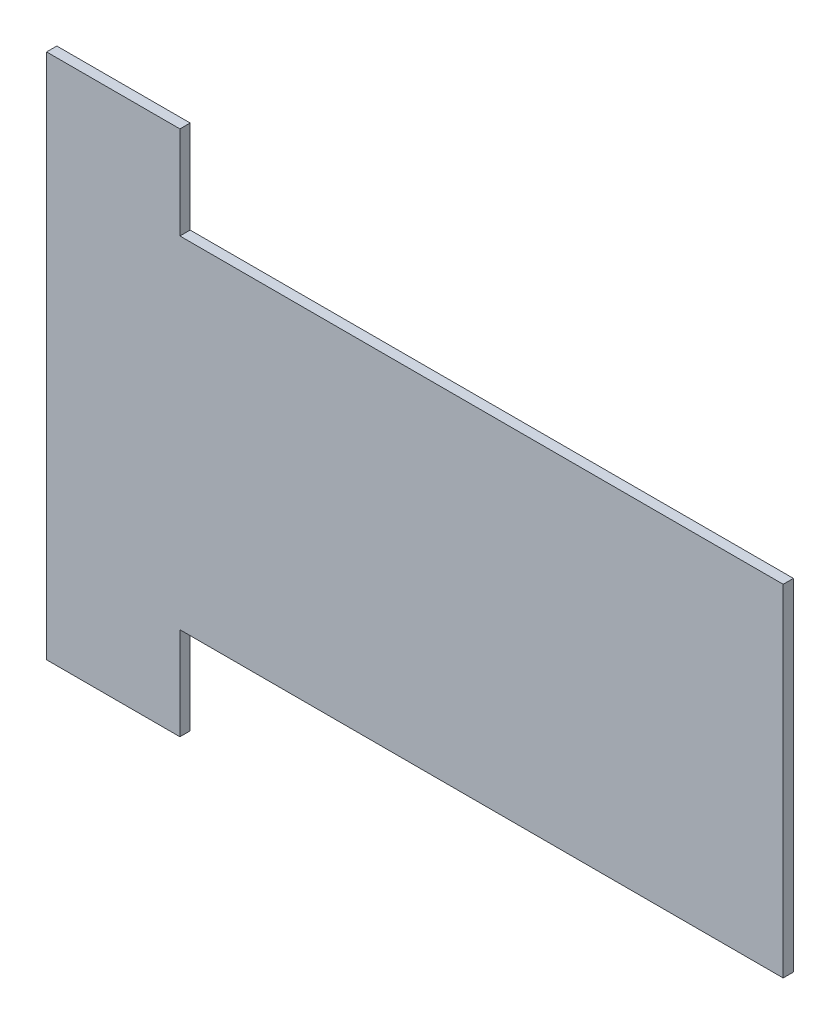
ISO-10303-21;
HEADER;
FILE_DESCRIPTION(('STEP AP214'),'2;1');
FILE_NAME('part.step','',(''),(''),'','','');
FILE_SCHEMA(('AUTOMOTIVE_DESIGN { 1 0 10303 214 1 1 1 1 }'));
ENDSEC;
DATA;
#1=APPLICATION_CONTEXT('core data for automotive mechanical design processes');
#2=APPLICATION_PROTOCOL_DEFINITION('international standard','automotive_design',2000,#1);
#3=PRODUCT_CONTEXT('',#1,'mechanical');
#4=PRODUCT('Part','Part','',(#3));
#5=PRODUCT_RELATED_PRODUCT_CATEGORY('part','',(#4));
#6=PRODUCT_DEFINITION_FORMATION('','',#4);
#7=PRODUCT_DEFINITION_CONTEXT('part definition',#1,'design');
#8=PRODUCT_DEFINITION('design','',#6,#7);
#9=PRODUCT_DEFINITION_SHAPE('','',#8);
#10=(LENGTH_UNIT() NAMED_UNIT(*) SI_UNIT(.MILLI.,.METRE.));
#11=(NAMED_UNIT(*) PLANE_ANGLE_UNIT() SI_UNIT($,.RADIAN.));
#12=(NAMED_UNIT(*) SI_UNIT($,.STERADIAN.) SOLID_ANGLE_UNIT());
#13=UNCERTAINTY_MEASURE_WITH_UNIT(LENGTH_MEASURE(1.E-05),#10,'distance_accuracy_value','');
#14=(GEOMETRIC_REPRESENTATION_CONTEXT(3) GLOBAL_UNCERTAINTY_ASSIGNED_CONTEXT((#13)) GLOBAL_UNIT_ASSIGNED_CONTEXT((#10,
#11,#12)) REPRESENTATION_CONTEXT('',''));
#15=CARTESIAN_POINT('',(0.,0.,0.));
#16=DIRECTION('',(0.,0.,1.));
#17=DIRECTION('',(1.,0.,0.));
#18=AXIS2_PLACEMENT_3D('',#15,#16,#17);
#19=CARTESIAN_POINT('',(-218.,860.775000000001,33.45));
#20=DIRECTION('',(1.,0.,0.));
#21=DIRECTION('',(0.,1.,0.));
#22=AXIS2_PLACEMENT_3D('',#19,#20,#21);
#23=PLANE('',#22);
#24=DIRECTION('',(0.,-1.,0.));
#25=VECTOR('',#24,1.);
#26=CARTESIAN_POINT('',(-218.,860.775000000001,0.));
#27=LINE('',#26,#25);
#28=CARTESIAN_POINT('',(-218.,860.775000000001,0.));
#29=VERTEX_POINT('',#28);
#30=CARTESIAN_POINT('',(-217.999999999999,-860.774999999999,0.));
#31=VERTEX_POINT('',#30);
#32=EDGE_CURVE('E146',#29,#31,#27,.T.);
#33=ORIENTED_EDGE('',*,*,#32,.T.);
#34=DIRECTION('',(0.,0.,-1.));
#35=VECTOR('',#34,1.);
#36=CARTESIAN_POINT('',(-217.999999999999,-860.774999999999,33.45));
#37=LINE('',#36,#35);
#38=CARTESIAN_POINT('',(-217.999999999999,-860.774999999999,33.45));
#39=VERTEX_POINT('',#38);
#40=EDGE_CURVE('E11',#39,#31,#37,.T.);
#41=ORIENTED_EDGE('',*,*,#40,.F.);
#42=DIRECTION('',(0.,-1.,0.));
#43=VECTOR('',#42,1.);
#44=CARTESIAN_POINT('',(-218.,860.775000000001,33.45));
#45=LINE('',#44,#43);
#46=CARTESIAN_POINT('',(-218.,860.775000000001,33.45));
#47=VERTEX_POINT('',#46);
#48=EDGE_CURVE('E168',#47,#39,#45,.T.);
#49=ORIENTED_EDGE('',*,*,#48,.F.);
#50=DIRECTION('',(0.,0.,-1.));
#51=VECTOR('',#50,1.);
#52=CARTESIAN_POINT('',(-218.,860.775000000001,33.45));
#53=LINE('',#52,#51);
#54=EDGE_CURVE('E142',#47,#29,#53,.T.);
#55=ORIENTED_EDGE('',*,*,#54,.T.);
#56=EDGE_LOOP('',(#33,#41,#49,#55));
#57=FACE_BOUND('',#56,.T.);
#58=ADVANCED_FACE('F45',(#57),#23,.F.);
#59=CARTESIAN_POINT('',(218.,-860.774999999999,33.45));
#60=DIRECTION('',(0.,1.,0.));
#61=DIRECTION('',(0.,0.,1.));
#62=AXIS2_PLACEMENT_3D('',#59,#60,#61);
#63=PLANE('',#62);
#64=DIRECTION('',(1.,0.,0.));
#65=VECTOR('',#64,1.);
#66=CARTESIAN_POINT('',(218.,-860.774999999999,0.));
#67=LINE('',#66,#65);
#68=CARTESIAN_POINT('',(218.,-860.774999999999,0.));
#69=VERTEX_POINT('',#68);
#70=EDGE_CURVE('E150',#31,#69,#67,.T.);
#71=ORIENTED_EDGE('',*,*,#70,.T.);
#72=DIRECTION('',(0.,0.,-1.));
#73=VECTOR('',#72,1.);
#74=CARTESIAN_POINT('',(218.,-860.774999999999,33.45));
#75=LINE('',#74,#73);
#76=CARTESIAN_POINT('',(218.,-860.774999999999,33.45));
#77=VERTEX_POINT('',#76);
#78=EDGE_CURVE('E54',#77,#69,#75,.T.);
#79=ORIENTED_EDGE('',*,*,#78,.F.);
#80=DIRECTION('',(1.,0.,0.));
#81=VECTOR('',#80,1.);
#82=CARTESIAN_POINT('',(218.,-860.774999999999,33.45));
#83=LINE('',#82,#81);
#84=EDGE_CURVE('E105',#39,#77,#83,.T.);
#85=ORIENTED_EDGE('',*,*,#84,.F.);
#86=ORIENTED_EDGE('',*,*,#40,.T.);
#87=EDGE_LOOP('',(#71,#79,#85,#86));
#88=FACE_BOUND('',#87,.T.);
#89=ADVANCED_FACE('F214',(#88),#63,.F.);
#90=CARTESIAN_POINT('',(218.,-557.5,33.45));
#91=DIRECTION('',(-1.,0.,0.));
#92=DIRECTION('',(0.,0.,1.));
#93=AXIS2_PLACEMENT_3D('',#90,#91,#92);
#94=PLANE('',#93);
#95=DIRECTION('',(0.,1.,0.));
#96=VECTOR('',#95,1.);
#97=CARTESIAN_POINT('',(218.,-557.5,0.));
#98=LINE('',#97,#96);
#99=CARTESIAN_POINT('',(218.,-557.5,0.));
#100=VERTEX_POINT('',#99);
#101=EDGE_CURVE('E153',#69,#100,#98,.T.);
#102=ORIENTED_EDGE('',*,*,#101,.T.);
#103=DIRECTION('',(0.,0.,-1.));
#104=VECTOR('',#103,1.);
#105=CARTESIAN_POINT('',(218.,-557.5,33.45));
#106=LINE('',#105,#104);
#107=CARTESIAN_POINT('',(218.,-557.5,33.45));
#108=VERTEX_POINT('',#107);
#109=EDGE_CURVE('E179',#108,#100,#106,.T.);
#110=ORIENTED_EDGE('',*,*,#109,.F.);
#111=DIRECTION('',(0.,1.,0.));
#112=VECTOR('',#111,1.);
#113=CARTESIAN_POINT('',(218.,-557.5,33.45));
#114=LINE('',#113,#112);
#115=EDGE_CURVE('E189',#77,#108,#114,.T.);
#116=ORIENTED_EDGE('',*,*,#115,.F.);
#117=ORIENTED_EDGE('',*,*,#78,.T.);
#118=EDGE_LOOP('',(#102,#110,#116,#117));
#119=FACE_BOUND('',#118,.T.);
#120=ADVANCED_FACE('F187',(#119),#94,.F.);
#121=CARTESIAN_POINT('',(218.,-557.5,33.45));
#122=DIRECTION('',(0.,1.,0.));
#123=DIRECTION('',(0.,0.,1.));
#124=AXIS2_PLACEMENT_3D('',#121,#122,#123);
#125=PLANE('',#124);
#126=DIRECTION('',(1.,0.,0.));
#127=VECTOR('',#126,1.);
#128=CARTESIAN_POINT('',(218.,-557.5,0.));
#129=LINE('',#128,#127);
#130=CARTESIAN_POINT('',(2190.65,-557.5,0.));
#131=VERTEX_POINT('',#130);
#132=EDGE_CURVE('E156',#100,#131,#129,.T.);
#133=ORIENTED_EDGE('',*,*,#132,.T.);
#134=DIRECTION('',(0.,0.,-1.));
#135=VECTOR('',#134,1.);
#136=CARTESIAN_POINT('',(2190.65,-557.5,33.45));
#137=LINE('',#136,#135);
#138=CARTESIAN_POINT('',(2190.65,-557.5,33.45));
#139=VERTEX_POINT('',#138);
#140=EDGE_CURVE('E175',#139,#131,#137,.T.);
#141=ORIENTED_EDGE('',*,*,#140,.F.);
#142=DIRECTION('',(1.,0.,0.));
#143=VECTOR('',#142,1.);
#144=CARTESIAN_POINT('',(218.,-557.5,33.45));
#145=LINE('',#144,#143);
#146=EDGE_CURVE('E202',#108,#139,#145,.T.);
#147=ORIENTED_EDGE('',*,*,#146,.F.);
#148=ORIENTED_EDGE('',*,*,#109,.T.);
#149=EDGE_LOOP('',(#133,#141,#147,#148));
#150=FACE_BOUND('',#149,.T.);
#151=ADVANCED_FACE('F197',(#150),#125,.F.);
#152=CARTESIAN_POINT('',(2190.65,-557.5,33.45));
#153=DIRECTION('',(-1.,0.,0.));
#154=DIRECTION('',(0.,-1.,0.));
#155=AXIS2_PLACEMENT_3D('',#152,#153,#154);
#156=PLANE('',#155);
#157=DIRECTION('',(0.,1.,0.));
#158=VECTOR('',#157,1.);
#159=CARTESIAN_POINT('',(2190.65,-557.5,0.));
#160=LINE('',#159,#158);
#161=CARTESIAN_POINT('',(2190.65,557.5,0.));
#162=VERTEX_POINT('',#161);
#163=EDGE_CURVE('E159',#131,#162,#160,.T.);
#164=ORIENTED_EDGE('',*,*,#163,.T.);
#165=DIRECTION('',(0.,0.,-1.));
#166=VECTOR('',#165,1.);
#167=CARTESIAN_POINT('',(2190.65,557.5,33.45));
#168=LINE('',#167,#166);
#169=CARTESIAN_POINT('',(2190.65,557.5,33.45));
#170=VERTEX_POINT('',#169);
#171=EDGE_CURVE('E135',#170,#162,#168,.T.);
#172=ORIENTED_EDGE('',*,*,#171,.F.);
#173=DIRECTION('',(0.,1.,0.));
#174=VECTOR('',#173,1.);
#175=CARTESIAN_POINT('',(2190.65,-557.5,33.45));
#176=LINE('',#175,#174);
#177=EDGE_CURVE('E124',#139,#170,#176,.T.);
#178=ORIENTED_EDGE('',*,*,#177,.F.);
#179=ORIENTED_EDGE('',*,*,#140,.T.);
#180=EDGE_LOOP('',(#164,#172,#178,#179));
#181=FACE_BOUND('',#180,.T.);
#182=ADVANCED_FACE('F200',(#181),#156,.F.);
#183=CARTESIAN_POINT('',(218.,557.5,33.45));
#184=DIRECTION('',(0.,-1.,0.));
#185=DIRECTION('',(0.,0.,-1.));
#186=AXIS2_PLACEMENT_3D('',#183,#184,#185);
#187=PLANE('',#186);
#188=DIRECTION('',(-1.,0.,0.));
#189=VECTOR('',#188,1.);
#190=CARTESIAN_POINT('',(218.,557.5,0.));
#191=LINE('',#190,#189);
#192=CARTESIAN_POINT('',(218.,557.5,0.));
#193=VERTEX_POINT('',#192);
#194=EDGE_CURVE('E133',#162,#193,#191,.T.);
#195=ORIENTED_EDGE('',*,*,#194,.T.);
#196=DIRECTION('',(0.,0.,-1.));
#197=VECTOR('',#196,1.);
#198=CARTESIAN_POINT('',(218.,557.5,33.45));
#199=LINE('',#198,#197);
#200=CARTESIAN_POINT('',(218.,557.5,33.45));
#201=VERTEX_POINT('',#200);
#202=EDGE_CURVE('E130',#201,#193,#199,.T.);
#203=ORIENTED_EDGE('',*,*,#202,.F.);
#204=DIRECTION('',(-1.,0.,0.));
#205=VECTOR('',#204,1.);
#206=CARTESIAN_POINT('',(218.,557.5,33.45));
#207=LINE('',#206,#205);
#208=EDGE_CURVE('E118',#170,#201,#207,.T.);
#209=ORIENTED_EDGE('',*,*,#208,.F.);
#210=ORIENTED_EDGE('',*,*,#171,.T.);
#211=EDGE_LOOP('',(#195,#203,#209,#210));
#212=FACE_BOUND('',#211,.T.);
#213=ADVANCED_FACE('F131',(#212),#187,.F.);
#214=CARTESIAN_POINT('',(218.,860.775000000001,33.45));
#215=DIRECTION('',(-1.,0.,0.));
#216=DIRECTION('',(0.,-1.,0.));
#217=AXIS2_PLACEMENT_3D('',#214,#215,#216);
#218=PLANE('',#217);
#219=DIRECTION('',(0.,1.,0.));
#220=VECTOR('',#219,1.);
#221=CARTESIAN_POINT('',(218.,860.775000000001,0.));
#222=LINE('',#221,#220);
#223=CARTESIAN_POINT('',(218.,860.775000000001,0.));
#224=VERTEX_POINT('',#223);
#225=EDGE_CURVE('E91',#193,#224,#222,.T.);
#226=ORIENTED_EDGE('',*,*,#225,.T.);
#227=DIRECTION('',(0.,0.,-1.));
#228=VECTOR('',#227,1.);
#229=CARTESIAN_POINT('',(218.,860.775000000001,33.45));
#230=LINE('',#229,#228);
#231=CARTESIAN_POINT('',(218.,860.775000000001,33.45));
#232=VERTEX_POINT('',#231);
#233=EDGE_CURVE('E136',#232,#224,#230,.T.);
#234=ORIENTED_EDGE('',*,*,#233,.F.);
#235=DIRECTION('',(0.,1.,0.));
#236=VECTOR('',#235,1.);
#237=CARTESIAN_POINT('',(218.,860.775000000001,33.45));
#238=LINE('',#237,#236);
#239=EDGE_CURVE('E122',#201,#232,#238,.T.);
#240=ORIENTED_EDGE('',*,*,#239,.F.);
#241=ORIENTED_EDGE('',*,*,#202,.T.);
#242=EDGE_LOOP('',(#226,#234,#240,#241));
#243=FACE_BOUND('',#242,.T.);
#244=ADVANCED_FACE('F138',(#243),#218,.F.);
#245=CARTESIAN_POINT('',(218.,860.775000000001,33.45));
#246=DIRECTION('',(0.,-1.,0.));
#247=DIRECTION('',(1.,0.,0.));
#248=AXIS2_PLACEMENT_3D('',#245,#246,#247);
#249=PLANE('',#248);
#250=DIRECTION('',(-1.,0.,0.));
#251=VECTOR('',#250,1.);
#252=CARTESIAN_POINT('',(218.,860.775000000001,0.));
#253=LINE('',#252,#251);
#254=EDGE_CURVE('E97',#224,#29,#253,.T.);
#255=ORIENTED_EDGE('',*,*,#254,.T.);
#256=ORIENTED_EDGE('',*,*,#54,.F.);
#257=DIRECTION('',(-1.,0.,0.));
#258=VECTOR('',#257,1.);
#259=CARTESIAN_POINT('',(218.,860.775000000001,33.45));
#260=LINE('',#259,#258);
#261=EDGE_CURVE('E62',#232,#47,#260,.T.);
#262=ORIENTED_EDGE('',*,*,#261,.F.);
#263=ORIENTED_EDGE('',*,*,#233,.T.);
#264=EDGE_LOOP('',(#255,#256,#262,#263));
#265=FACE_BOUND('',#264,.T.);
#266=ADVANCED_FACE('F230',(#265),#249,.F.);
#267=CARTESIAN_POINT('',(0.,0.,33.45));
#268=DIRECTION('',(0.,0.,-1.));
#269=DIRECTION('',(-1.,0.,0.));
#270=AXIS2_PLACEMENT_3D('',#267,#268,#269);
#271=PLANE('',#270);
#272=ORIENTED_EDGE('',*,*,#48,.T.);
#273=ORIENTED_EDGE('',*,*,#84,.T.);
#274=ORIENTED_EDGE('',*,*,#115,.T.);
#275=ORIENTED_EDGE('',*,*,#146,.T.);
#276=ORIENTED_EDGE('',*,*,#177,.T.);
#277=ORIENTED_EDGE('',*,*,#208,.T.);
#278=ORIENTED_EDGE('',*,*,#239,.T.);
#279=ORIENTED_EDGE('',*,*,#261,.T.);
#280=EDGE_LOOP('',(#272,#273,#274,#275,#276,#277,#278,#279));
#281=FACE_BOUND('',#280,.T.);
#282=ADVANCED_FACE('F120',(#281),#271,.F.);
#283=CARTESIAN_POINT('',(0.,0.,0.));
#284=DIRECTION('',(0.,0.,-1.));
#285=DIRECTION('',(-1.,0.,0.));
#286=AXIS2_PLACEMENT_3D('',#283,#284,#285);
#287=PLANE('',#286);
#288=ORIENTED_EDGE('',*,*,#32,.F.);
#289=ORIENTED_EDGE('',*,*,#254,.F.);
#290=ORIENTED_EDGE('',*,*,#225,.F.);
#291=ORIENTED_EDGE('',*,*,#194,.F.);
#292=ORIENTED_EDGE('',*,*,#163,.F.);
#293=ORIENTED_EDGE('',*,*,#132,.F.);
#294=ORIENTED_EDGE('',*,*,#101,.F.);
#295=ORIENTED_EDGE('',*,*,#70,.F.);
#296=EDGE_LOOP('',(#288,#289,#290,#291,#292,#293,#294,#295));
#297=FACE_BOUND('',#296,.T.);
#298=ADVANCED_FACE('F193',(#297),#287,.T.);
#299=CLOSED_SHELL('',(#58,#89,#120,#151,#182,#213,#244,#266,#282,#298));
#300=MANIFOLD_SOLID_BREP('B2',#299);
#301=ADVANCED_BREP_SHAPE_REPRESENTATION('',(#18,#300),#14);
#302=SHAPE_DEFINITION_REPRESENTATION(#9,#301);
ENDSEC;
END-ISO-10303-21;
